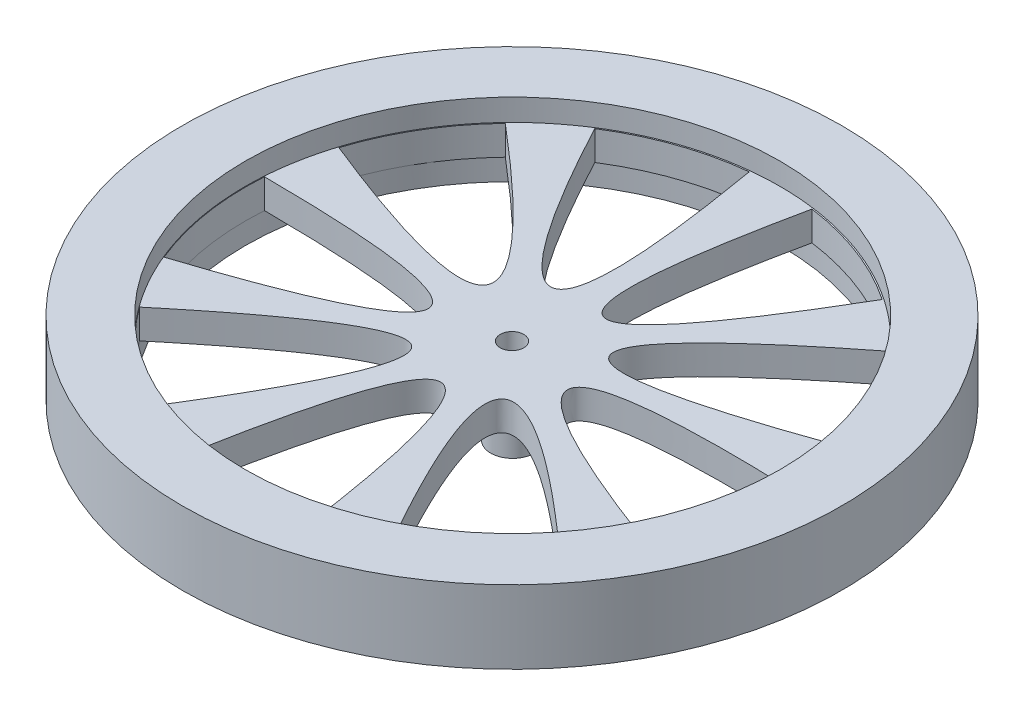
ISO-10303-21;
HEADER;
FILE_DESCRIPTION(('STEP AP214'),'2;1');
FILE_NAME('part.step','',(''),(''),'','','');
FILE_SCHEMA(('AUTOMOTIVE_DESIGN { 1 0 10303 214 1 1 1 1 }'));
ENDSEC;
DATA;
#1=APPLICATION_CONTEXT('core data for automotive mechanical design processes');
#2=APPLICATION_PROTOCOL_DEFINITION('international standard','automotive_design',2000,#1);
#3=PRODUCT_CONTEXT('',#1,'mechanical');
#4=PRODUCT('Part','Part','',(#3));
#5=PRODUCT_RELATED_PRODUCT_CATEGORY('part','',(#4));
#6=PRODUCT_DEFINITION_FORMATION('','',#4);
#7=PRODUCT_DEFINITION_CONTEXT('part definition',#1,'design');
#8=PRODUCT_DEFINITION('design','',#6,#7);
#9=PRODUCT_DEFINITION_SHAPE('','',#8);
#10=(LENGTH_UNIT() NAMED_UNIT(*) SI_UNIT(.MILLI.,.METRE.));
#11=(NAMED_UNIT(*) PLANE_ANGLE_UNIT() SI_UNIT($,.RADIAN.));
#12=(NAMED_UNIT(*) SI_UNIT($,.STERADIAN.) SOLID_ANGLE_UNIT());
#13=UNCERTAINTY_MEASURE_WITH_UNIT(LENGTH_MEASURE(1.E-05),#10,'distance_accuracy_value','');
#14=(GEOMETRIC_REPRESENTATION_CONTEXT(3) GLOBAL_UNCERTAINTY_ASSIGNED_CONTEXT((#13)) GLOBAL_UNIT_ASSIGNED_CONTEXT((#10,
#11,#12)) REPRESENTATION_CONTEXT('',''));
#15=CARTESIAN_POINT('',(0.,0.,0.));
#16=DIRECTION('',(0.,0.,1.));
#17=DIRECTION('',(1.,0.,0.));
#18=AXIS2_PLACEMENT_3D('',#15,#16,#17);
#19=CARTESIAN_POINT('',(0.,5.,0.0887249566365412));
#20=DIRECTION('',(0.,-1.,0.));
#21=DIRECTION('',(0.,0.,-1.));
#22=AXIS2_PLACEMENT_3D('',#19,#20,#21);
#23=CYLINDRICAL_SURFACE('',#22,1.6);
#24=CARTESIAN_POINT('',(0.,-9.8,0.0887249566365412));
#25=DIRECTION('',(0.,-1.,0.));
#26=DIRECTION('',(0.,0.,-1.));
#27=AXIS2_PLACEMENT_3D('',#24,#25,#26);
#28=CIRCLE('',#27,1.6);
#29=CARTESIAN_POINT('',(0.,-9.8,-1.51127504336346));
#30=VERTEX_POINT('',#29);
#31=EDGE_CURVE('E433',#30,#30,#28,.T.);
#32=ORIENTED_EDGE('',*,*,#31,.T.);
#33=EDGE_LOOP('',(#32));
#34=FACE_BOUND('',#33,.T.);
#35=CARTESIAN_POINT('',(0.,2.,0.0887249566365412));
#36=DIRECTION('',(0.,1.,0.));
#37=DIRECTION('',(0.,0.,1.));
#38=AXIS2_PLACEMENT_3D('',#35,#36,#37);
#39=CIRCLE('',#38,1.6);
#40=CARTESIAN_POINT('',(0.,2.,1.68872495663654));
#41=VERTEX_POINT('',#40);
#42=EDGE_CURVE('E472',#41,#41,#39,.T.);
#43=ORIENTED_EDGE('',*,*,#42,.T.);
#44=EDGE_LOOP('',(#43));
#45=FACE_BOUND('',#44,.T.);
#46=ADVANCED_FACE('F44',(#34,#45),#23,.F.);
#47=CARTESIAN_POINT('',(0.,5.,0.0887249566365412));
#48=DIRECTION('',(0.,1.,0.));
#49=DIRECTION('',(0.,0.,1.));
#50=AXIS2_PLACEMENT_3D('',#47,#48,#49);
#51=PLANE('',#50);
#52=CARTESIAN_POINT('',(0.,5.,0.));
#53=DIRECTION('',(0.,1.,0.));
#54=DIRECTION('',(0.,0.,1.));
#55=AXIS2_PLACEMENT_3D('',#52,#53,#54);
#56=CIRCLE('',#55,36.5014809236704);
#57=CARTESIAN_POINT('',(0.,5.,36.5014809236704));
#58=VERTEX_POINT('',#57);
#59=EDGE_CURVE('E461',#58,#58,#56,.T.);
#60=ORIENTED_EDGE('',*,*,#59,.F.);
#61=EDGE_LOOP('',(#60));
#62=FACE_BOUND('',#61,.T.);
#63=CARTESIAN_POINT('',(0.,5.,0.0887249566365412));
#64=DIRECTION('',(0.,1.,0.));
#65=DIRECTION('',(0.,0.,1.));
#66=AXIS2_PLACEMENT_3D('',#63,#64,#65);
#67=CIRCLE('',#66,45.);
#68=CARTESIAN_POINT('',(0.,5.,45.0887249566365));
#69=VERTEX_POINT('',#68);
#70=EDGE_CURVE('E474',#69,#69,#67,.T.);
#71=ORIENTED_EDGE('',*,*,#70,.T.);
#72=EDGE_LOOP('',(#71));
#73=FACE_BOUND('',#72,.T.);
#74=ADVANCED_FACE('F503',(#62,#73),#51,.T.);
#75=CARTESIAN_POINT('',(0.,-5.,0.0887249566365412));
#76=DIRECTION('',(0.,1.,0.));
#77=DIRECTION('',(0.,0.,1.));
#78=AXIS2_PLACEMENT_3D('',#75,#76,#77);
#79=PLANE('',#78);
#80=CARTESIAN_POINT('',(0.,-5.,0.));
#81=DIRECTION('',(0.,-1.,0.));
#82=DIRECTION('',(0.,0.,-1.));
#83=AXIS2_PLACEMENT_3D('',#80,#81,#82);
#84=CIRCLE('',#83,36.5014809236704);
#85=CARTESIAN_POINT('',(0.,-5.,-36.5014809236704));
#86=VERTEX_POINT('',#85);
#87=EDGE_CURVE('E462',#86,#86,#84,.T.);
#88=ORIENTED_EDGE('',*,*,#87,.F.);
#89=EDGE_LOOP('',(#88));
#90=FACE_BOUND('',#89,.T.);
#91=CARTESIAN_POINT('',(0.,-5.,0.0887249566365412));
#92=DIRECTION('',(0.,1.,0.));
#93=DIRECTION('',(0.,0.,1.));
#94=AXIS2_PLACEMENT_3D('',#91,#92,#93);
#95=CIRCLE('',#94,45.);
#96=CARTESIAN_POINT('',(0.,-5.,45.0887249566365));
#97=VERTEX_POINT('',#96);
#98=EDGE_CURVE('E477',#97,#97,#95,.T.);
#99=ORIENTED_EDGE('',*,*,#98,.F.);
#100=EDGE_LOOP('',(#99));
#101=FACE_BOUND('',#100,.T.);
#102=ADVANCED_FACE('F509',(#90,#101),#79,.F.);
#103=CARTESIAN_POINT('',(0.,5.,0.0887249566365412));
#104=DIRECTION('',(0.,-1.,0.));
#105=DIRECTION('',(0.,0.,-1.));
#106=AXIS2_PLACEMENT_3D('',#103,#104,#105);
#107=CYLINDRICAL_SURFACE('',#106,45.);
#108=ORIENTED_EDGE('',*,*,#70,.F.);
#109=EDGE_LOOP('',(#108));
#110=FACE_BOUND('',#109,.T.);
#111=ORIENTED_EDGE('',*,*,#98,.T.);
#112=EDGE_LOOP('',(#111));
#113=FACE_BOUND('',#112,.T.);
#114=ADVANCED_FACE('F46',(#110,#113),#107,.T.);
#115=CARTESIAN_POINT('',(0.,2.,0.));
#116=DIRECTION('',(0.,1.,0.));
#117=DIRECTION('',(0.,0.,1.));
#118=AXIS2_PLACEMENT_3D('',#115,#116,#117);
#119=CYLINDRICAL_SURFACE('',#118,36.5014809236704);
#120=DIRECTION('',(0.,-1.,0.));
#121=VECTOR('',#120,1.);
#122=CARTESIAN_POINT('',(-8.80159725878,8.,35.4244265347417));
#123=LINE('',#122,#121);
#124=CARTESIAN_POINT('',(-8.80159725878,2.,35.4244265347417));
#125=VERTEX_POINT('',#124);
#126=CARTESIAN_POINT('',(-8.80159725878001,-2.,35.4244265347417));
#127=VERTEX_POINT('',#126);
#128=EDGE_CURVE('E446',#125,#127,#123,.T.);
#129=ORIENTED_EDGE('',*,*,#128,.F.);
#130=CARTESIAN_POINT('',(0.,2.,0.));
#131=DIRECTION('',(0.,1.,0.));
#132=DIRECTION('',(0.,0.,1.));
#133=AXIS2_PLACEMENT_3D('',#130,#131,#132);
#134=CIRCLE('',#133,36.5014809236704);
#135=CARTESIAN_POINT('',(7.77143926148394,2.,35.6645880591118));
#136=VERTEX_POINT('',#135);
#137=EDGE_CURVE('E456',#136,#125,#134,.T.);
#138=ORIENTED_EDGE('',*,*,#137,.F.);
#139=DIRECTION('',(0.,-1.,0.));
#140=VECTOR('',#139,1.);
#141=CARTESIAN_POINT('',(7.77143926148394,8.,35.6645880591118));
#142=LINE('',#141,#140);
#143=CARTESIAN_POINT('',(7.77143926148394,-2.,35.6645880591118));
#144=VERTEX_POINT('',#143);
#145=EDGE_CURVE('E443',#136,#144,#142,.T.);
#146=ORIENTED_EDGE('',*,*,#145,.T.);
#147=CARTESIAN_POINT('',(0.,-2.,0.));
#148=DIRECTION('',(0.,-1.,0.));
#149=DIRECTION('',(0.,0.,-1.));
#150=AXIS2_PLACEMENT_3D('',#147,#148,#149);
#151=CIRCLE('',#150,36.5014809236704);
#152=EDGE_CURVE('E444',#127,#144,#151,.T.);
#153=ORIENTED_EDGE('',*,*,#152,.F.);
#154=EDGE_LOOP('',(#129,#138,#146,#153));
#155=FACE_BOUND('',#154,.T.);
#156=ORIENTED_EDGE('',*,*,#59,.T.);
#157=EDGE_LOOP('',(#156));
#158=FACE_BOUND('',#157,.T.);
#159=ORIENTED_EDGE('',*,*,#87,.T.);
#160=EDGE_LOOP('',(#159));
#161=FACE_BOUND('',#160,.T.);
#162=ADVANCED_FACE('F452',(#155,#158,#161),#119,.F.);
#163=CARTESIAN_POINT('',(0.,2.,0.));
#164=DIRECTION('',(0.,1.,0.));
#165=DIRECTION('',(0.,0.,1.));
#166=AXIS2_PLACEMENT_3D('',#163,#164,#165);
#167=PLANE('',#166);
#168=CARTESIAN_POINT('',(-29.4557658246465,2.,21.49988513086));
#169=CARTESIAN_POINT('',(10.6678043736023,2.,-11.8648802067777));
#170=CARTESIAN_POINT('',(-16.9144561448788,2.,32.3368020621628));
#171=B_SPLINE_CURVE_WITH_KNOTS('',2,(#168,#169,#170),.UNSPECIFIED.,.F.,.F.,(3,3),(0.,1.),.UNSPECIFIED.);
#172=CARTESIAN_POINT('',(-16.9144561448788,2.,32.3368020621628));
#173=VERTEX_POINT('',#172);
#174=CARTESIAN_POINT('',(-29.4557658246465,2.,21.49988513086));
#175=VERTEX_POINT('',#174);
#176=EDGE_CURVE('E171',#173,#175,#171,.F.);
#177=ORIENTED_EDGE('',*,*,#176,.F.);
#178=CARTESIAN_POINT('',(0.0570313027959434,2.,0.0207576966391458));
#179=DIRECTION('',(0.,1.,0.));
#180=DIRECTION('',(0.,0.,1.));
#181=AXIS2_PLACEMENT_3D('',#178,#179,#180);
#182=CIRCLE('',#181,36.5014809236704);
#183=EDGE_CURVE('E173',#175,#173,#182,.T.);
#184=ORIENTED_EDGE('',*,*,#183,.F.);
#185=EDGE_LOOP('',(#177,#184));
#186=FACE_BOUND('',#185,.T.);
#187=CARTESIAN_POINT('',(-36.3272541967891,2.,-2.44317607708021));
#188=CARTESIAN_POINT('',(15.8556415508061,2.,-2.21113538012383));
#189=CARTESIAN_POINT('',(-33.6858895378125,2.,13.9197823900828));
#190=B_SPLINE_CURVE_WITH_KNOTS('',2,(#187,#188,#189),.UNSPECIFIED.,.F.,.F.,(3,3),(0.,1.),.UNSPECIFIED.);
#191=CARTESIAN_POINT('',(-33.6858895378125,2.,13.9197823900828));
#192=VERTEX_POINT('',#191);
#193=CARTESIAN_POINT('',(-36.3272541967891,2.,-2.4431760770802));
#194=VERTEX_POINT('',#193);
#195=EDGE_CURVE('E237',#192,#194,#190,.F.);
#196=ORIENTED_EDGE('',*,*,#195,.F.);
#197=CARTESIAN_POINT('',(0.0873770251813376,2.,0.0733180296030275));
#198=DIRECTION('',(0.,1.,0.));
#199=DIRECTION('',(0.,0.,1.));
#200=AXIS2_PLACEMENT_3D('',#197,#198,#199);
#201=CIRCLE('',#200,36.5014809236704);
#202=EDGE_CURVE('E659',#194,#192,#201,.T.);
#203=ORIENTED_EDGE('',*,*,#202,.F.);
#204=EDGE_LOOP('',(#196,#203));
#205=FACE_BOUND('',#204,.T.);
#206=CARTESIAN_POINT('',(-26.2008165977952,2.,-25.2015326523988));
#207=CARTESIAN_POINT('',(13.6244478305604,2.,8.51873965820074));
#208=CARTESIAN_POINT('',(-34.6953208390431,2.,-10.9689427701879));
#209=B_SPLINE_CURVE_WITH_KNOTS('',2,(#206,#207,#208),.UNSPECIFIED.,.F.,.F.,(3,3),(0.,1.),.UNSPECIFIED.);
#210=CARTESIAN_POINT('',(-34.6953208390431,2.,-10.9689427701879));
#211=VERTEX_POINT('',#210);
#212=CARTESIAN_POINT('',(-26.2008165977952,2.,-25.2015326523987));
#213=VERTEX_POINT('',#212);
#214=EDGE_CURVE('E261',#211,#213,#209,.F.);
#215=ORIENTED_EDGE('',*,*,#214,.F.);
#216=CARTESIAN_POINT('',(0.0768380663969178,2.,0.133087434954811));
#217=DIRECTION('',(0.,1.,0.));
#218=DIRECTION('',(0.,0.,1.));
#219=AXIS2_PLACEMENT_3D('',#216,#217,#218);
#220=CIRCLE('',#219,36.5014809236704);
#221=EDGE_CURVE('E257',#213,#211,#220,.T.);
#222=ORIENTED_EDGE('',*,*,#221,.F.);
#223=EDGE_LOOP('',(#215,#222));
#224=FACE_BOUND('',#223,.T.);
#225=CARTESIAN_POINT('',(-3.81472572305179,2.,-36.1262966225446));
#226=CARTESIAN_POINT('',(5.01822355152437,2.,15.304117128486));
#227=CARTESIAN_POINT('',(-19.4704259241455,2.,-30.6836623087895));
#228=B_SPLINE_CURVE_WITH_KNOTS('',2,(#225,#226,#227),.UNSPECIFIED.,.F.,.F.,(3,3),(0.,1.),.UNSPECIFIED.);
#229=CARTESIAN_POINT('',(-19.4704259241455,2.,-30.6836623087895));
#230=VERTEX_POINT('',#229);
#231=CARTESIAN_POINT('',(-3.8147257230518,2.,-36.1262966225446));
#232=VERTEX_POINT('',#231);
#233=EDGE_CURVE('E300',#230,#232,#228,.F.);
#234=ORIENTED_EDGE('',*,*,#233,.F.);
#235=CARTESIAN_POINT('',(0.0303457223853942,2.,0.172099143667448));
#236=DIRECTION('',(0.,1.,0.));
#237=DIRECTION('',(0.,0.,1.));
#238=AXIS2_PLACEMENT_3D('',#235,#236,#237);
#239=CIRCLE('',#238,36.5014809236704);
#240=EDGE_CURVE('E727',#232,#230,#239,.T.);
#241=ORIENTED_EDGE('',*,*,#240,.F.);
#242=EDGE_LOOP('',(#234,#241));
#243=FACE_BOUND('',#242,.T.);
#244=CARTESIAN_POINT('',(20.3563177134615,2.,-30.1056495106592));
#245=CARTESIAN_POINT('',(-5.93608329861239,2.,14.9700435013149));
#246=CARTESIAN_POINT('',(4.86489767034039,2.,-35.9996398489086));
#247=B_SPLINE_CURVE_WITH_KNOTS('',2,(#244,#245,#246),.UNSPECIFIED.,.F.,.F.,(3,3),(0.,1.),.UNSPECIFIED.);
#248=CARTESIAN_POINT('',(4.86489767034039,2.,-35.9996398489086));
#249=VERTEX_POINT('',#248);
#250=CARTESIAN_POINT('',(20.3563177134614,2.,-30.1056495106592));
#251=VERTEX_POINT('',#250);
#252=EDGE_CURVE('E324',#249,#251,#247,.F.);
#253=ORIENTED_EDGE('',*,*,#252,.F.);
#254=CARTESIAN_POINT('',(-0.0303457223853931,2.,0.172099143667449));
#255=DIRECTION('',(0.,1.,0.));
#256=DIRECTION('',(0.,0.,1.));
#257=AXIS2_PLACEMENT_3D('',#254,#255,#256);
#258=CIRCLE('',#257,36.5014809236704);
#259=EDGE_CURVE('E320',#251,#249,#258,.T.);
#260=ORIENTED_EDGE('',*,*,#259,.F.);
#261=EDGE_LOOP('',(#253,#260));
#262=FACE_BOUND('',#261,.T.);
#263=CARTESIAN_POINT('',(35.0024138565749,2.,-9.95671901243322));
#264=CARTESIAN_POINT('',(-14.1128308011111,2.,7.6728355396555));
#265=CARTESIAN_POINT('',(26.923881577559,2.,-24.4294704190141));
#266=B_SPLINE_CURVE_WITH_KNOTS('',2,(#263,#264,#265),.UNSPECIFIED.,.F.,.F.,(3,3),(0.,1.),.UNSPECIFIED.);
#267=CARTESIAN_POINT('',(26.923881577559,2.,-24.4294704190141));
#268=VERTEX_POINT('',#267);
#269=CARTESIAN_POINT('',(35.0024138565749,2.,-9.95671901243323));
#270=VERTEX_POINT('',#269);
#271=EDGE_CURVE('E363',#268,#270,#266,.F.);
#272=ORIENTED_EDGE('',*,*,#271,.F.);
#273=CARTESIAN_POINT('',(-0.0768380663969172,2.,0.133087434954812));
#274=DIRECTION('',(0.,1.,0.));
#275=DIRECTION('',(0.,0.,1.));
#276=AXIS2_PLACEMENT_3D('',#273,#274,#275);
#277=CIRCLE('',#276,36.5014809236704);
#278=EDGE_CURVE('E711',#270,#268,#277,.T.);
#279=ORIENTED_EDGE('',*,*,#278,.F.);
#280=EDGE_LOOP('',(#272,#279));
#281=FACE_BOUND('',#280,.T.);
#282=CARTESIAN_POINT('',(33.2704915476983,2.,14.8925863615944));
#283=CARTESIAN_POINT('',(-15.6860279251267,2.,-3.17306205179878));
#284=CARTESIAN_POINT('',(36.3848820690245,2.,-1.38696488346341));
#285=B_SPLINE_CURVE_WITH_KNOTS('',2,(#282,#283,#284),.UNSPECIFIED.,.F.,.F.,(3,3),(0.,1.),.UNSPECIFIED.);
#286=CARTESIAN_POINT('',(36.3848820690245,2.,-1.38696488346341));
#287=VERTEX_POINT('',#286);
#288=CARTESIAN_POINT('',(33.2704915476983,2.,14.8925863615944));
#289=VERTEX_POINT('',#288);
#290=EDGE_CURVE('E387',#287,#289,#285,.F.);
#291=ORIENTED_EDGE('',*,*,#290,.F.);
#292=CARTESIAN_POINT('',(-0.0873770251813378,2.,0.0733180296030287));
#293=DIRECTION('',(0.,1.,0.));
#294=DIRECTION('',(0.,0.,1.));
#295=AXIS2_PLACEMENT_3D('',#292,#293,#294);
#296=CIRCLE('',#295,36.5014809236704);
#297=EDGE_CURVE('E383',#289,#287,#296,.T.);
#298=ORIENTED_EDGE('',*,*,#297,.F.);
#299=EDGE_LOOP('',(#291,#298));
#300=FACE_BOUND('',#299,.T.);
#301=CARTESIAN_POINT('',(15.9709364833275,2.,32.8150004576493));
#302=CARTESIAN_POINT('',(-9.91955825219364,2.,-12.4927332512815));
#303=CARTESIAN_POINT('',(28.8209918674721,2.,22.3460323287358));
#304=B_SPLINE_CURVE_WITH_KNOTS('',2,(#301,#302,#303),.UNSPECIFIED.,.F.,.F.,(3,3),(0.,1.),.UNSPECIFIED.);
#305=CARTESIAN_POINT('',(28.8209918674721,2.,22.3460323287358));
#306=VERTEX_POINT('',#305);
#307=CARTESIAN_POINT('',(15.9709364833275,2.,32.8150004576492));
#308=VERTEX_POINT('',#307);
#309=EDGE_CURVE('E422',#306,#308,#304,.F.);
#310=ORIENTED_EDGE('',*,*,#309,.F.);
#311=CARTESIAN_POINT('',(-0.0570313027959443,2.,0.0207576966391466));
#312=DIRECTION('',(0.,1.,0.));
#313=DIRECTION('',(0.,0.,1.));
#314=AXIS2_PLACEMENT_3D('',#311,#312,#313);
#315=CIRCLE('',#314,36.5014809236704);
#316=EDGE_CURVE('E695',#308,#306,#315,.T.);
#317=ORIENTED_EDGE('',*,*,#316,.F.);
#318=EDGE_LOOP('',(#310,#317));
#319=FACE_BOUND('',#318,.T.);
#320=CARTESIAN_POINT('',(-8.80159725878001,2.,35.4244265347417));
#321=CARTESIAN_POINT('',(0.488382970550821,2.,-15.9254003279467));
#322=CARTESIAN_POINT('',(7.77143926148394,2.,35.6645880591118));
#323=B_SPLINE_CURVE_WITH_KNOTS('',2,(#320,#321,#322),.UNSPECIFIED.,.F.,.F.,(3,3),(0.,1.),.UNSPECIFIED.);
#324=EDGE_CURVE('E12',#136,#125,#323,.F.);
#325=ORIENTED_EDGE('',*,*,#324,.F.);
#326=ORIENTED_EDGE('',*,*,#137,.T.);
#327=EDGE_LOOP('',(#325,#326));
#328=FACE_BOUND('',#327,.T.);
#329=ORIENTED_EDGE('',*,*,#42,.F.);
#330=EDGE_LOOP('',(#329));
#331=FACE_BOUND('',#330,.T.);
#332=ADVANCED_FACE('F494',(#186,#205,#224,#243,#262,#281,#300,#319,#328,#331),#167,.T.);
#333=CARTESIAN_POINT('',(0.,-2.,0.));
#334=DIRECTION('',(0.,-1.,0.));
#335=DIRECTION('',(0.,0.,-1.));
#336=AXIS2_PLACEMENT_3D('',#333,#334,#335);
#337=PLANE('',#336);
#338=CARTESIAN_POINT('',(-29.4557658246465,-2.,21.49988513086));
#339=CARTESIAN_POINT('',(10.6678043736023,-2.,-11.8648802067777));
#340=CARTESIAN_POINT('',(-16.9144561448788,-2.,32.3368020621628));
#341=B_SPLINE_CURVE_WITH_KNOTS('',2,(#338,#339,#340),.UNSPECIFIED.,.F.,.F.,(3,3),(0.,1.),.UNSPECIFIED.);
#342=CARTESIAN_POINT('',(-29.4557658246465,-2.,21.49988513086));
#343=VERTEX_POINT('',#342);
#344=CARTESIAN_POINT('',(-16.9144561448788,-2.,32.3368020621628));
#345=VERTEX_POINT('',#344);
#346=EDGE_CURVE('E68',#343,#345,#341,.T.);
#347=ORIENTED_EDGE('',*,*,#346,.F.);
#348=CARTESIAN_POINT('',(0.0570313027959434,-2.,0.0207576966391458));
#349=DIRECTION('',(0.,-1.,0.));
#350=DIRECTION('',(0.64278760968653,0.,-0.766044443118986));
#351=AXIS2_PLACEMENT_3D('',#348,#349,#350);
#352=CIRCLE('',#351,36.5014809236704);
#353=EDGE_CURVE('E177',#345,#343,#352,.T.);
#354=ORIENTED_EDGE('',*,*,#353,.F.);
#355=EDGE_LOOP('',(#347,#354));
#356=FACE_BOUND('',#355,.T.);
#357=CARTESIAN_POINT('',(-36.3272541967891,-2.,-2.44317607708021));
#358=CARTESIAN_POINT('',(15.8556415508061,-2.,-2.21113538012383));
#359=CARTESIAN_POINT('',(-33.6858895378125,-2.,13.9197823900828));
#360=B_SPLINE_CURVE_WITH_KNOTS('',2,(#357,#358,#359),.UNSPECIFIED.,.F.,.F.,(3,3),(0.,1.),.UNSPECIFIED.);
#361=CARTESIAN_POINT('',(-36.3272541967891,-2.,-2.4431760770802));
#362=VERTEX_POINT('',#361);
#363=CARTESIAN_POINT('',(-33.6858895378125,-2.,13.9197823900828));
#364=VERTEX_POINT('',#363);
#365=EDGE_CURVE('E199',#362,#364,#360,.T.);
#366=ORIENTED_EDGE('',*,*,#365,.F.);
#367=CARTESIAN_POINT('',(0.0873770251813376,-2.,0.0733180296030275));
#368=DIRECTION('',(0.,-1.,0.));
#369=DIRECTION('',(0.984807753012206,0.,-0.17364817766694));
#370=AXIS2_PLACEMENT_3D('',#367,#368,#369);
#371=CIRCLE('',#370,36.5014809236704);
#372=EDGE_CURVE('E669',#364,#362,#371,.T.);
#373=ORIENTED_EDGE('',*,*,#372,.F.);
#374=EDGE_LOOP('',(#366,#373));
#375=FACE_BOUND('',#374,.T.);
#376=CARTESIAN_POINT('',(-26.2008165977952,-2.,-25.2015326523988));
#377=CARTESIAN_POINT('',(13.6244478305604,-2.,8.51873965820074));
#378=CARTESIAN_POINT('',(-34.6953208390431,-2.,-10.9689427701879));
#379=B_SPLINE_CURVE_WITH_KNOTS('',2,(#376,#377,#378),.UNSPECIFIED.,.F.,.F.,(3,3),(0.,1.),.UNSPECIFIED.);
#380=CARTESIAN_POINT('',(-26.2008165977952,-2.,-25.2015326523987));
#381=VERTEX_POINT('',#380);
#382=CARTESIAN_POINT('',(-34.6953208390431,-2.,-10.9689427701879));
#383=VERTEX_POINT('',#382);
#384=EDGE_CURVE('E241',#381,#383,#379,.T.);
#385=ORIENTED_EDGE('',*,*,#384,.F.);
#386=CARTESIAN_POINT('',(0.0768380663969178,-2.,0.133087434954811));
#387=DIRECTION('',(0.,-1.,0.));
#388=DIRECTION('',(0.866025403784443,0.,0.499999999999992));
#389=AXIS2_PLACEMENT_3D('',#386,#387,#388);
#390=CIRCLE('',#389,36.5014809236704);
#391=EDGE_CURVE('E248',#383,#381,#390,.T.);
#392=ORIENTED_EDGE('',*,*,#391,.F.);
#393=EDGE_LOOP('',(#385,#392));
#394=FACE_BOUND('',#393,.T.);
#395=CARTESIAN_POINT('',(-3.81472572305179,-2.,-36.1262966225446));
#396=CARTESIAN_POINT('',(5.01822355152437,-2.,15.304117128486));
#397=CARTESIAN_POINT('',(-19.4704259241455,-2.,-30.6836623087895));
#398=B_SPLINE_CURVE_WITH_KNOTS('',2,(#395,#396,#397),.UNSPECIFIED.,.F.,.F.,(3,3),(0.,1.),.UNSPECIFIED.);
#399=CARTESIAN_POINT('',(-3.8147257230518,-2.,-36.1262966225446));
#400=VERTEX_POINT('',#399);
#401=CARTESIAN_POINT('',(-19.4704259241455,-2.,-30.6836623087895));
#402=VERTEX_POINT('',#401);
#403=EDGE_CURVE('E266',#400,#402,#398,.T.);
#404=ORIENTED_EDGE('',*,*,#403,.F.);
#405=CARTESIAN_POINT('',(0.0303457223853942,-2.,0.172099143667448));
#406=DIRECTION('',(0.,-1.,0.));
#407=DIRECTION('',(0.342020143325676,0.,0.939692620785906));
#408=AXIS2_PLACEMENT_3D('',#405,#406,#407);
#409=CIRCLE('',#408,36.5014809236704);
#410=EDGE_CURVE('E734',#402,#400,#409,.T.);
#411=ORIENTED_EDGE('',*,*,#410,.F.);
#412=EDGE_LOOP('',(#404,#411));
#413=FACE_BOUND('',#412,.T.);
#414=CARTESIAN_POINT('',(20.3563177134615,-2.,-30.1056495106592));
#415=CARTESIAN_POINT('',(-5.93608329861239,-2.,14.9700435013149));
#416=CARTESIAN_POINT('',(4.86489767034039,-2.,-35.9996398489086));
#417=B_SPLINE_CURVE_WITH_KNOTS('',2,(#414,#415,#416),.UNSPECIFIED.,.F.,.F.,(3,3),(0.,1.),.UNSPECIFIED.);
#418=CARTESIAN_POINT('',(20.3563177134614,-2.,-30.1056495106592));
#419=VERTEX_POINT('',#418);
#420=CARTESIAN_POINT('',(4.86489767034039,-2.,-35.9996398489086));
#421=VERTEX_POINT('',#420);
#422=EDGE_CURVE('E304',#419,#421,#417,.T.);
#423=ORIENTED_EDGE('',*,*,#422,.F.);
#424=CARTESIAN_POINT('',(-0.0303457223853931,-2.,0.172099143667449));
#425=DIRECTION('',(0.,-1.,0.));
#426=DIRECTION('',(-0.342020143325663,0.,0.939692620785911));
#427=AXIS2_PLACEMENT_3D('',#424,#425,#426);
#428=CIRCLE('',#427,36.5014809236704);
#429=EDGE_CURVE('E311',#421,#419,#428,.T.);
#430=ORIENTED_EDGE('',*,*,#429,.F.);
#431=EDGE_LOOP('',(#423,#430));
#432=FACE_BOUND('',#431,.T.);
#433=CARTESIAN_POINT('',(35.0024138565749,-2.,-9.95671901243322));
#434=CARTESIAN_POINT('',(-14.1128308011111,-2.,7.6728355396555));
#435=CARTESIAN_POINT('',(26.923881577559,-2.,-24.4294704190141));
#436=B_SPLINE_CURVE_WITH_KNOTS('',2,(#433,#434,#435),.UNSPECIFIED.,.F.,.F.,(3,3),(0.,1.),.UNSPECIFIED.);
#437=CARTESIAN_POINT('',(35.0024138565749,-2.,-9.95671901243323));
#438=VERTEX_POINT('',#437);
#439=CARTESIAN_POINT('',(26.923881577559,-2.,-24.4294704190141));
#440=VERTEX_POINT('',#439);
#441=EDGE_CURVE('E329',#438,#440,#436,.T.);
#442=ORIENTED_EDGE('',*,*,#441,.F.);
#443=CARTESIAN_POINT('',(-0.0768380663969172,-2.,0.133087434954812));
#444=DIRECTION('',(0.,-1.,0.));
#445=DIRECTION('',(-0.866025403784436,0.,0.500000000000004));
#446=AXIS2_PLACEMENT_3D('',#443,#444,#445);
#447=CIRCLE('',#446,36.5014809236704);
#448=EDGE_CURVE('E718',#440,#438,#447,.T.);
#449=ORIENTED_EDGE('',*,*,#448,.F.);
#450=EDGE_LOOP('',(#442,#449));
#451=FACE_BOUND('',#450,.T.);
#452=CARTESIAN_POINT('',(33.2704915476983,-2.,14.8925863615944));
#453=CARTESIAN_POINT('',(-15.6860279251267,-2.,-3.17306205179878));
#454=CARTESIAN_POINT('',(36.3848820690245,-2.,-1.38696488346341));
#455=B_SPLINE_CURVE_WITH_KNOTS('',2,(#452,#453,#454),.UNSPECIFIED.,.F.,.F.,(3,3),(0.,1.),.UNSPECIFIED.);
#456=CARTESIAN_POINT('',(33.2704915476983,-2.,14.8925863615944));
#457=VERTEX_POINT('',#456);
#458=CARTESIAN_POINT('',(36.3848820690245,-2.,-1.38696488346341));
#459=VERTEX_POINT('',#458);
#460=EDGE_CURVE('E367',#457,#459,#455,.T.);
#461=ORIENTED_EDGE('',*,*,#460,.F.);
#462=CARTESIAN_POINT('',(-0.0873770251813378,-2.,0.0733180296030287));
#463=DIRECTION('',(0.,-1.,0.));
#464=DIRECTION('',(-0.984807753012209,0.,-0.173648177666927));
#465=AXIS2_PLACEMENT_3D('',#462,#463,#464);
#466=CIRCLE('',#465,36.5014809236704);
#467=EDGE_CURVE('E374',#459,#457,#466,.T.);
#468=ORIENTED_EDGE('',*,*,#467,.F.);
#469=EDGE_LOOP('',(#461,#468));
#470=FACE_BOUND('',#469,.T.);
#471=CARTESIAN_POINT('',(15.9709364833275,-2.,32.8150004576493));
#472=CARTESIAN_POINT('',(-9.91955825219364,-2.,-12.4927332512815));
#473=CARTESIAN_POINT('',(28.8209918674721,-2.,22.3460323287358));
#474=B_SPLINE_CURVE_WITH_KNOTS('',2,(#471,#472,#473),.UNSPECIFIED.,.F.,.F.,(3,3),(0.,1.),.UNSPECIFIED.);
#475=CARTESIAN_POINT('',(15.9709364833275,-2.,32.8150004576493));
#476=VERTEX_POINT('',#475);
#477=CARTESIAN_POINT('',(28.8209918674721,-2.,22.3460323287358));
#478=VERTEX_POINT('',#477);
#479=EDGE_CURVE('E392',#476,#478,#474,.T.);
#480=ORIENTED_EDGE('',*,*,#479,.F.);
#481=CARTESIAN_POINT('',(-0.0570313027959443,-2.,0.0207576966391466));
#482=DIRECTION('',(0.,-1.,0.));
#483=DIRECTION('',(-0.642787609686541,0.,-0.766044443118977));
#484=AXIS2_PLACEMENT_3D('',#481,#482,#483);
#485=CIRCLE('',#484,36.5014809236704);
#486=EDGE_CURVE('E702',#478,#476,#485,.T.);
#487=ORIENTED_EDGE('',*,*,#486,.F.);
#488=EDGE_LOOP('',(#480,#487));
#489=FACE_BOUND('',#488,.T.);
#490=CARTESIAN_POINT('',(-8.80159725878001,-2.,35.4244265347417));
#491=CARTESIAN_POINT('',(0.488382970550821,-2.,-15.9254003279467));
#492=CARTESIAN_POINT('',(7.77143926148394,-2.,35.6645880591118));
#493=B_SPLINE_CURVE_WITH_KNOTS('',2,(#490,#491,#492),.UNSPECIFIED.,.F.,.F.,(3,3),(0.,1.),.UNSPECIFIED.);
#494=EDGE_CURVE('E439',#127,#144,#493,.T.);
#495=ORIENTED_EDGE('',*,*,#494,.F.);
#496=ORIENTED_EDGE('',*,*,#152,.T.);
#497=EDGE_LOOP('',(#495,#496));
#498=FACE_BOUND('',#497,.T.);
#499=CARTESIAN_POINT('',(0.,-2.,0.));
#500=DIRECTION('',(0.,-1.,0.));
#501=DIRECTION('',(0.,0.,-1.));
#502=AXIS2_PLACEMENT_3D('',#499,#500,#501);
#503=CIRCLE('',#502,3.);
#504=CARTESIAN_POINT('',(0.,-2.,-3.));
#505=VERTEX_POINT('',#504);
#506=EDGE_CURVE('E53',#505,#505,#503,.T.);
#507=ORIENTED_EDGE('',*,*,#506,.F.);
#508=EDGE_LOOP('',(#507));
#509=FACE_BOUND('',#508,.T.);
#510=ADVANCED_FACE('F181',(#356,#375,#394,#413,#432,#451,#470,#489,#498,#509),#337,.T.);
#511=CARTESIAN_POINT('',(0.,-1.,0.));
#512=DIRECTION('',(0.,-1.,0.));
#513=DIRECTION('',(0.,0.,-1.));
#514=AXIS2_PLACEMENT_3D('',#511,#512,#513);
#515=CYLINDRICAL_SURFACE('',#514,3.);
#516=ORIENTED_EDGE('',*,*,#506,.T.);
#517=EDGE_LOOP('',(#516));
#518=FACE_BOUND('',#517,.T.);
#519=CARTESIAN_POINT('',(0.,-9.8,0.));
#520=DIRECTION('',(0.,-1.,0.));
#521=DIRECTION('',(0.,0.,-1.));
#522=AXIS2_PLACEMENT_3D('',#519,#520,#521);
#523=CIRCLE('',#522,3.);
#524=CARTESIAN_POINT('',(0.,-9.8,-3.));
#525=VERTEX_POINT('',#524);
#526=EDGE_CURVE('E466',#525,#525,#523,.T.);
#527=ORIENTED_EDGE('',*,*,#526,.F.);
#528=EDGE_LOOP('',(#527));
#529=FACE_BOUND('',#528,.T.);
#530=ADVANCED_FACE('F491',(#518,#529),#515,.T.);
#531=CARTESIAN_POINT('',(0.,-9.8,0.));
#532=DIRECTION('',(0.,-1.,0.));
#533=DIRECTION('',(0.,0.,-1.));
#534=AXIS2_PLACEMENT_3D('',#531,#532,#533);
#535=PLANE('',#534);
#536=ORIENTED_EDGE('',*,*,#526,.T.);
#537=EDGE_LOOP('',(#536));
#538=FACE_BOUND('',#537,.T.);
#539=ORIENTED_EDGE('',*,*,#31,.F.);
#540=EDGE_LOOP('',(#539));
#541=FACE_BOUND('',#540,.T.);
#542=ADVANCED_FACE('F414',(#538,#541),#535,.T.);
#543=CARTESIAN_POINT('',(-8.80159725878001,8.,35.4244265347417));
#544=CARTESIAN_POINT('',(0.488382970550821,8.,-15.9254003279467));
#545=CARTESIAN_POINT('',(7.77143926148394,8.,35.6645880591118));
#546=B_SPLINE_CURVE_WITH_KNOTS('',2,(#543,#544,#545),.UNSPECIFIED.,.F.,.F.,(3,3),(0.,1.),.UNSPECIFIED.);
#547=DIRECTION('',(0.,-1.,0.));
#548=VECTOR('',#547,1.);
#549=SURFACE_OF_LINEAR_EXTRUSION('',#546,#548);
#550=ORIENTED_EDGE('',*,*,#324,.T.);
#551=ORIENTED_EDGE('',*,*,#128,.T.);
#552=ORIENTED_EDGE('',*,*,#494,.T.);
#553=ORIENTED_EDGE('',*,*,#145,.F.);
#554=EDGE_LOOP('',(#550,#551,#552,#553));
#555=FACE_BOUND('',#554,.T.);
#556=ADVANCED_FACE('F409',(#555),#549,.F.);
#557=CARTESIAN_POINT('',(15.9709364833275,8.,32.8150004576493));
#558=CARTESIAN_POINT('',(-9.91955825219364,8.,-12.4927332512815));
#559=CARTESIAN_POINT('',(28.8209918674721,8.,22.3460323287358));
#560=B_SPLINE_CURVE_WITH_KNOTS('',2,(#557,#558,#559),.UNSPECIFIED.,.F.,.F.,(3,3),(0.,1.),.UNSPECIFIED.);
#561=DIRECTION('',(0.,-1.,0.));
#562=VECTOR('',#561,1.);
#563=SURFACE_OF_LINEAR_EXTRUSION('',#560,#562);
#564=ORIENTED_EDGE('',*,*,#309,.T.);
#565=DIRECTION('',(0.,-1.,0.));
#566=VECTOR('',#565,1.);
#567=CARTESIAN_POINT('',(15.9709364833275,8.,32.8150004576493));
#568=LINE('',#567,#566);
#569=EDGE_CURVE('E697',#308,#476,#568,.T.);
#570=ORIENTED_EDGE('',*,*,#569,.T.);
#571=ORIENTED_EDGE('',*,*,#479,.T.);
#572=DIRECTION('',(0.,-1.,0.));
#573=VECTOR('',#572,1.);
#574=CARTESIAN_POINT('',(28.8209918674721,8.,22.3460323287358));
#575=LINE('',#574,#573);
#576=EDGE_CURVE('E699',#306,#478,#575,.T.);
#577=ORIENTED_EDGE('',*,*,#576,.F.);
#578=EDGE_LOOP('',(#564,#570,#571,#577));
#579=FACE_BOUND('',#578,.T.);
#580=ADVANCED_FACE('F406',(#579),#563,.F.);
#581=CARTESIAN_POINT('',(-0.0570313027959443,8.,0.0207576966391466));
#582=DIRECTION('',(0.,-1.,0.));
#583=DIRECTION('',(0.,0.,-1.));
#584=AXIS2_PLACEMENT_3D('',#581,#582,#583);
#585=CYLINDRICAL_SURFACE('',#584,36.5014809236704);
#586=ORIENTED_EDGE('',*,*,#316,.T.);
#587=ORIENTED_EDGE('',*,*,#576,.T.);
#588=ORIENTED_EDGE('',*,*,#486,.T.);
#589=ORIENTED_EDGE('',*,*,#569,.F.);
#590=EDGE_LOOP('',(#586,#587,#588,#589));
#591=FACE_BOUND('',#590,.T.);
#592=ADVANCED_FACE('F355',(#591),#585,.F.);
#593=CARTESIAN_POINT('',(33.2704915476983,8.,14.8925863615944));
#594=CARTESIAN_POINT('',(-15.6860279251267,8.,-3.17306205179878));
#595=CARTESIAN_POINT('',(36.3848820690245,8.,-1.38696488346341));
#596=B_SPLINE_CURVE_WITH_KNOTS('',2,(#593,#594,#595),.UNSPECIFIED.,.F.,.F.,(3,3),(0.,1.),.UNSPECIFIED.);
#597=DIRECTION('',(0.,-1.,0.));
#598=VECTOR('',#597,1.);
#599=SURFACE_OF_LINEAR_EXTRUSION('',#596,#598);
#600=ORIENTED_EDGE('',*,*,#290,.T.);
#601=DIRECTION('',(0.,-1.,0.));
#602=VECTOR('',#601,1.);
#603=CARTESIAN_POINT('',(33.2704915476983,8.,14.8925863615944));
#604=LINE('',#603,#602);
#605=EDGE_CURVE('E381',#289,#457,#604,.T.);
#606=ORIENTED_EDGE('',*,*,#605,.T.);
#607=ORIENTED_EDGE('',*,*,#460,.T.);
#608=DIRECTION('',(0.,-1.,0.));
#609=VECTOR('',#608,1.);
#610=CARTESIAN_POINT('',(36.3848820690245,8.,-1.38696488346341));
#611=LINE('',#610,#609);
#612=EDGE_CURVE('E380',#287,#459,#611,.T.);
#613=ORIENTED_EDGE('',*,*,#612,.F.);
#614=EDGE_LOOP('',(#600,#606,#607,#613));
#615=FACE_BOUND('',#614,.T.);
#616=ADVANCED_FACE('F350',(#615),#599,.F.);
#617=CARTESIAN_POINT('',(-0.0873770251813378,8.,0.0733180296030287));
#618=DIRECTION('',(0.,-1.,0.));
#619=DIRECTION('',(0.,0.,-1.));
#620=AXIS2_PLACEMENT_3D('',#617,#618,#619);
#621=CYLINDRICAL_SURFACE('',#620,36.5014809236704);
#622=ORIENTED_EDGE('',*,*,#297,.T.);
#623=ORIENTED_EDGE('',*,*,#612,.T.);
#624=ORIENTED_EDGE('',*,*,#467,.T.);
#625=ORIENTED_EDGE('',*,*,#605,.F.);
#626=EDGE_LOOP('',(#622,#623,#624,#625));
#627=FACE_BOUND('',#626,.T.);
#628=ADVANCED_FACE('F346',(#627),#621,.F.);
#629=CARTESIAN_POINT('',(35.0024138565749,8.,-9.95671901243322));
#630=CARTESIAN_POINT('',(-14.1128308011111,8.,7.6728355396555));
#631=CARTESIAN_POINT('',(26.923881577559,8.,-24.4294704190141));
#632=B_SPLINE_CURVE_WITH_KNOTS('',2,(#629,#630,#631),.UNSPECIFIED.,.F.,.F.,(3,3),(0.,1.),.UNSPECIFIED.);
#633=DIRECTION('',(0.,-1.,0.));
#634=VECTOR('',#633,1.);
#635=SURFACE_OF_LINEAR_EXTRUSION('',#632,#634);
#636=ORIENTED_EDGE('',*,*,#271,.T.);
#637=DIRECTION('',(0.,-1.,0.));
#638=VECTOR('',#637,1.);
#639=CARTESIAN_POINT('',(35.0024138565749,8.,-9.95671901243323));
#640=LINE('',#639,#638);
#641=EDGE_CURVE('E713',#270,#438,#640,.T.);
#642=ORIENTED_EDGE('',*,*,#641,.T.);
#643=ORIENTED_EDGE('',*,*,#441,.T.);
#644=DIRECTION('',(0.,-1.,0.));
#645=VECTOR('',#644,1.);
#646=CARTESIAN_POINT('',(26.923881577559,8.,-24.4294704190141));
#647=LINE('',#646,#645);
#648=EDGE_CURVE('E715',#268,#440,#647,.T.);
#649=ORIENTED_EDGE('',*,*,#648,.F.);
#650=EDGE_LOOP('',(#636,#642,#643,#649));
#651=FACE_BOUND('',#650,.T.);
#652=ADVANCED_FACE('F343',(#651),#635,.F.);
#653=CARTESIAN_POINT('',(-0.0768380663969172,8.,0.133087434954812));
#654=DIRECTION('',(0.,-1.,0.));
#655=DIRECTION('',(0.,0.,-1.));
#656=AXIS2_PLACEMENT_3D('',#653,#654,#655);
#657=CYLINDRICAL_SURFACE('',#656,36.5014809236704);
#658=ORIENTED_EDGE('',*,*,#278,.T.);
#659=ORIENTED_EDGE('',*,*,#648,.T.);
#660=ORIENTED_EDGE('',*,*,#448,.T.);
#661=ORIENTED_EDGE('',*,*,#641,.F.);
#662=EDGE_LOOP('',(#658,#659,#660,#661));
#663=FACE_BOUND('',#662,.T.);
#664=ADVANCED_FACE('F292',(#663),#657,.F.);
#665=CARTESIAN_POINT('',(20.3563177134615,8.,-30.1056495106592));
#666=CARTESIAN_POINT('',(-5.93608329861239,8.,14.9700435013149));
#667=CARTESIAN_POINT('',(4.86489767034039,8.,-35.9996398489086));
#668=B_SPLINE_CURVE_WITH_KNOTS('',2,(#665,#666,#667),.UNSPECIFIED.,.F.,.F.,(3,3),(0.,1.),.UNSPECIFIED.);
#669=DIRECTION('',(0.,-1.,0.));
#670=VECTOR('',#669,1.);
#671=SURFACE_OF_LINEAR_EXTRUSION('',#668,#670);
#672=ORIENTED_EDGE('',*,*,#252,.T.);
#673=DIRECTION('',(0.,-1.,0.));
#674=VECTOR('',#673,1.);
#675=CARTESIAN_POINT('',(20.3563177134614,8.,-30.1056495106592));
#676=LINE('',#675,#674);
#677=EDGE_CURVE('E318',#251,#419,#676,.T.);
#678=ORIENTED_EDGE('',*,*,#677,.T.);
#679=ORIENTED_EDGE('',*,*,#422,.T.);
#680=DIRECTION('',(0.,-1.,0.));
#681=VECTOR('',#680,1.);
#682=CARTESIAN_POINT('',(4.86489767034039,8.,-35.9996398489086));
#683=LINE('',#682,#681);
#684=EDGE_CURVE('E317',#249,#421,#683,.T.);
#685=ORIENTED_EDGE('',*,*,#684,.F.);
#686=EDGE_LOOP('',(#672,#678,#679,#685));
#687=FACE_BOUND('',#686,.T.);
#688=ADVANCED_FACE('F287',(#687),#671,.F.);
#689=CARTESIAN_POINT('',(-0.0303457223853931,8.,0.172099143667449));
#690=DIRECTION('',(0.,-1.,0.));
#691=DIRECTION('',(0.,0.,-1.));
#692=AXIS2_PLACEMENT_3D('',#689,#690,#691);
#693=CYLINDRICAL_SURFACE('',#692,36.5014809236704);
#694=ORIENTED_EDGE('',*,*,#259,.T.);
#695=ORIENTED_EDGE('',*,*,#684,.T.);
#696=ORIENTED_EDGE('',*,*,#429,.T.);
#697=ORIENTED_EDGE('',*,*,#677,.F.);
#698=EDGE_LOOP('',(#694,#695,#696,#697));
#699=FACE_BOUND('',#698,.T.);
#700=ADVANCED_FACE('F283',(#699),#693,.F.);
#701=CARTESIAN_POINT('',(-3.81472572305179,8.,-36.1262966225446));
#702=CARTESIAN_POINT('',(5.01822355152437,8.,15.304117128486));
#703=CARTESIAN_POINT('',(-19.4704259241455,8.,-30.6836623087895));
#704=B_SPLINE_CURVE_WITH_KNOTS('',2,(#701,#702,#703),.UNSPECIFIED.,.F.,.F.,(3,3),(0.,1.),.UNSPECIFIED.);
#705=DIRECTION('',(0.,-1.,0.));
#706=VECTOR('',#705,1.);
#707=SURFACE_OF_LINEAR_EXTRUSION('',#704,#706);
#708=ORIENTED_EDGE('',*,*,#233,.T.);
#709=DIRECTION('',(0.,-1.,0.));
#710=VECTOR('',#709,1.);
#711=CARTESIAN_POINT('',(-3.8147257230518,8.,-36.1262966225446));
#712=LINE('',#711,#710);
#713=EDGE_CURVE('E729',#232,#400,#712,.T.);
#714=ORIENTED_EDGE('',*,*,#713,.T.);
#715=ORIENTED_EDGE('',*,*,#403,.T.);
#716=DIRECTION('',(0.,-1.,0.));
#717=VECTOR('',#716,1.);
#718=CARTESIAN_POINT('',(-19.4704259241455,8.,-30.6836623087895));
#719=LINE('',#718,#717);
#720=EDGE_CURVE('E731',#230,#402,#719,.T.);
#721=ORIENTED_EDGE('',*,*,#720,.F.);
#722=EDGE_LOOP('',(#708,#714,#715,#721));
#723=FACE_BOUND('',#722,.T.);
#724=ADVANCED_FACE('F280',(#723),#707,.F.);
#725=CARTESIAN_POINT('',(0.0303457223853942,8.,0.172099143667448));
#726=DIRECTION('',(0.,-1.,0.));
#727=DIRECTION('',(0.,0.,-1.));
#728=AXIS2_PLACEMENT_3D('',#725,#726,#727);
#729=CYLINDRICAL_SURFACE('',#728,36.5014809236704);
#730=ORIENTED_EDGE('',*,*,#240,.T.);
#731=ORIENTED_EDGE('',*,*,#720,.T.);
#732=ORIENTED_EDGE('',*,*,#410,.T.);
#733=ORIENTED_EDGE('',*,*,#713,.F.);
#734=EDGE_LOOP('',(#730,#731,#732,#733));
#735=FACE_BOUND('',#734,.T.);
#736=ADVANCED_FACE('F229',(#735),#729,.F.);
#737=CARTESIAN_POINT('',(-26.2008165977952,8.,-25.2015326523988));
#738=CARTESIAN_POINT('',(13.6244478305604,8.,8.51873965820074));
#739=CARTESIAN_POINT('',(-34.6953208390431,8.,-10.9689427701879));
#740=B_SPLINE_CURVE_WITH_KNOTS('',2,(#737,#738,#739),.UNSPECIFIED.,.F.,.F.,(3,3),(0.,1.),.UNSPECIFIED.);
#741=DIRECTION('',(0.,-1.,0.));
#742=VECTOR('',#741,1.);
#743=SURFACE_OF_LINEAR_EXTRUSION('',#740,#742);
#744=ORIENTED_EDGE('',*,*,#214,.T.);
#745=DIRECTION('',(0.,-1.,0.));
#746=VECTOR('',#745,1.);
#747=CARTESIAN_POINT('',(-26.2008165977952,8.,-25.2015326523987));
#748=LINE('',#747,#746);
#749=EDGE_CURVE('E255',#213,#381,#748,.T.);
#750=ORIENTED_EDGE('',*,*,#749,.T.);
#751=ORIENTED_EDGE('',*,*,#384,.T.);
#752=DIRECTION('',(0.,-1.,0.));
#753=VECTOR('',#752,1.);
#754=CARTESIAN_POINT('',(-34.6953208390431,8.,-10.9689427701879));
#755=LINE('',#754,#753);
#756=EDGE_CURVE('E254',#211,#383,#755,.T.);
#757=ORIENTED_EDGE('',*,*,#756,.F.);
#758=EDGE_LOOP('',(#744,#750,#751,#757));
#759=FACE_BOUND('',#758,.T.);
#760=ADVANCED_FACE('F224',(#759),#743,.F.);
#761=CARTESIAN_POINT('',(0.0768380663969178,8.,0.133087434954811));
#762=DIRECTION('',(0.,-1.,0.));
#763=DIRECTION('',(0.,0.,-1.));
#764=AXIS2_PLACEMENT_3D('',#761,#762,#763);
#765=CYLINDRICAL_SURFACE('',#764,36.5014809236704);
#766=ORIENTED_EDGE('',*,*,#221,.T.);
#767=ORIENTED_EDGE('',*,*,#756,.T.);
#768=ORIENTED_EDGE('',*,*,#391,.T.);
#769=ORIENTED_EDGE('',*,*,#749,.F.);
#770=EDGE_LOOP('',(#766,#767,#768,#769));
#771=FACE_BOUND('',#770,.T.);
#772=ADVANCED_FACE('F219',(#771),#765,.F.);
#773=CARTESIAN_POINT('',(-36.3272541967891,8.,-2.44317607708021));
#774=CARTESIAN_POINT('',(15.8556415508061,8.,-2.21113538012383));
#775=CARTESIAN_POINT('',(-33.6858895378125,8.,13.9197823900828));
#776=B_SPLINE_CURVE_WITH_KNOTS('',2,(#773,#774,#775),.UNSPECIFIED.,.F.,.F.,(3,3),(0.,1.),.UNSPECIFIED.);
#777=DIRECTION('',(0.,-1.,0.));
#778=VECTOR('',#777,1.);
#779=SURFACE_OF_LINEAR_EXTRUSION('',#776,#778);
#780=ORIENTED_EDGE('',*,*,#195,.T.);
#781=DIRECTION('',(0.,-1.,0.));
#782=VECTOR('',#781,1.);
#783=CARTESIAN_POINT('',(-36.3272541967891,8.,-2.4431760770802));
#784=LINE('',#783,#782);
#785=EDGE_CURVE('E664',#194,#362,#784,.T.);
#786=ORIENTED_EDGE('',*,*,#785,.T.);
#787=ORIENTED_EDGE('',*,*,#365,.T.);
#788=DIRECTION('',(0.,-1.,0.));
#789=VECTOR('',#788,1.);
#790=CARTESIAN_POINT('',(-33.6858895378125,8.,13.9197823900828));
#791=LINE('',#790,#789);
#792=EDGE_CURVE('E662',#192,#364,#791,.T.);
#793=ORIENTED_EDGE('',*,*,#792,.F.);
#794=EDGE_LOOP('',(#780,#786,#787,#793));
#795=FACE_BOUND('',#794,.T.);
#796=ADVANCED_FACE('F214',(#795),#779,.F.);
#797=CARTESIAN_POINT('',(0.0873770251813376,8.,0.0733180296030275));
#798=DIRECTION('',(0.,-1.,0.));
#799=DIRECTION('',(0.,0.,-1.));
#800=AXIS2_PLACEMENT_3D('',#797,#798,#799);
#801=CYLINDRICAL_SURFACE('',#800,36.5014809236704);
#802=ORIENTED_EDGE('',*,*,#202,.T.);
#803=ORIENTED_EDGE('',*,*,#792,.T.);
#804=ORIENTED_EDGE('',*,*,#372,.T.);
#805=ORIENTED_EDGE('',*,*,#785,.F.);
#806=EDGE_LOOP('',(#802,#803,#804,#805));
#807=FACE_BOUND('',#806,.T.);
#808=ADVANCED_FACE('F218',(#807),#801,.F.);
#809=CARTESIAN_POINT('',(-29.4557658246465,8.,21.49988513086));
#810=CARTESIAN_POINT('',(10.6678043736023,8.,-11.8648802067777));
#811=CARTESIAN_POINT('',(-16.9144561448788,8.,32.3368020621628));
#812=B_SPLINE_CURVE_WITH_KNOTS('',2,(#809,#810,#811),.UNSPECIFIED.,.F.,.F.,(3,3),(0.,1.),.UNSPECIFIED.);
#813=DIRECTION('',(0.,-1.,0.));
#814=VECTOR('',#813,1.);
#815=SURFACE_OF_LINEAR_EXTRUSION('',#812,#814);
#816=ORIENTED_EDGE('',*,*,#176,.T.);
#817=DIRECTION('',(0.,-1.,0.));
#818=VECTOR('',#817,1.);
#819=CARTESIAN_POINT('',(-29.4557658246465,8.,21.49988513086));
#820=LINE('',#819,#818);
#821=EDGE_CURVE('E61',#175,#343,#820,.T.);
#822=ORIENTED_EDGE('',*,*,#821,.T.);
#823=ORIENTED_EDGE('',*,*,#346,.T.);
#824=DIRECTION('',(0.,-1.,0.));
#825=VECTOR('',#824,1.);
#826=CARTESIAN_POINT('',(-16.9144561448788,8.,32.3368020621628));
#827=LINE('',#826,#825);
#828=EDGE_CURVE('E174',#173,#345,#827,.T.);
#829=ORIENTED_EDGE('',*,*,#828,.F.);
#830=EDGE_LOOP('',(#816,#822,#823,#829));
#831=FACE_BOUND('',#830,.T.);
#832=ADVANCED_FACE('F169',(#831),#815,.F.);
#833=CARTESIAN_POINT('',(0.0570313027959434,8.,0.0207576966391458));
#834=DIRECTION('',(0.,-1.,0.));
#835=DIRECTION('',(0.,0.,-1.));
#836=AXIS2_PLACEMENT_3D('',#833,#834,#835);
#837=CYLINDRICAL_SURFACE('',#836,36.5014809236704);
#838=ORIENTED_EDGE('',*,*,#183,.T.);
#839=ORIENTED_EDGE('',*,*,#828,.T.);
#840=ORIENTED_EDGE('',*,*,#353,.T.);
#841=ORIENTED_EDGE('',*,*,#821,.F.);
#842=EDGE_LOOP('',(#838,#839,#840,#841));
#843=FACE_BOUND('',#842,.T.);
#844=ADVANCED_FACE('F178',(#843),#837,.F.);
#845=CLOSED_SHELL('',(#46,#74,#102,#114,#162,#332,#510,#530,#542,#556,#580,#592,#616,#628,#652,
#664,#688,#700,#724,#736,#760,#772,#796,#808,#832,#844));
#846=MANIFOLD_SOLID_BREP('B2',#845);
#847=ADVANCED_BREP_SHAPE_REPRESENTATION('',(#18,#846),#14);
#848=SHAPE_DEFINITION_REPRESENTATION(#9,#847);
ENDSEC;
END-ISO-10303-21;
